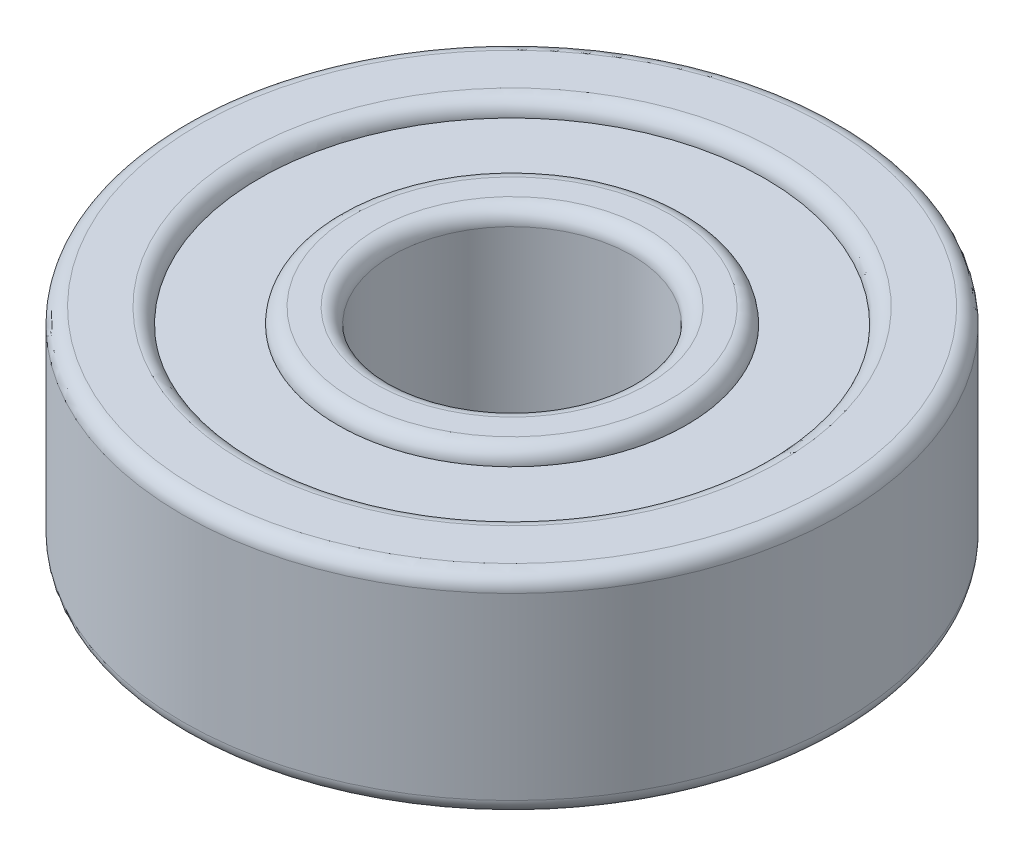
ISO-10303-21;
HEADER;
FILE_DESCRIPTION(('STEP AP214'),'2;1');
FILE_NAME('part.step','',(''),(''),'','','');
FILE_SCHEMA(('AUTOMOTIVE_DESIGN { 1 0 10303 214 1 1 1 1 }'));
ENDSEC;
DATA;
#1=APPLICATION_CONTEXT('core data for automotive mechanical design processes');
#2=APPLICATION_PROTOCOL_DEFINITION('international standard','automotive_design',2000,#1);
#3=PRODUCT_CONTEXT('',#1,'mechanical');
#4=PRODUCT('Part','Part','',(#3));
#5=PRODUCT_RELATED_PRODUCT_CATEGORY('part','',(#4));
#6=PRODUCT_DEFINITION_FORMATION('','',#4);
#7=PRODUCT_DEFINITION_CONTEXT('part definition',#1,'design');
#8=PRODUCT_DEFINITION('design','',#6,#7);
#9=PRODUCT_DEFINITION_SHAPE('','',#8);
#10=(LENGTH_UNIT() NAMED_UNIT(*) SI_UNIT(.MILLI.,.METRE.));
#11=(NAMED_UNIT(*) PLANE_ANGLE_UNIT() SI_UNIT($,.RADIAN.));
#12=(NAMED_UNIT(*) SI_UNIT($,.STERADIAN.) SOLID_ANGLE_UNIT());
#13=UNCERTAINTY_MEASURE_WITH_UNIT(LENGTH_MEASURE(1.E-05),#10,'distance_accuracy_value','');
#14=(GEOMETRIC_REPRESENTATION_CONTEXT(3) GLOBAL_UNCERTAINTY_ASSIGNED_CONTEXT((#13)) GLOBAL_UNIT_ASSIGNED_CONTEXT((#10,
#11,#12)) REPRESENTATION_CONTEXT('',''));
#15=CARTESIAN_POINT('',(0.,0.,0.));
#16=DIRECTION('',(0.,0.,1.));
#17=DIRECTION('',(1.,0.,0.));
#18=AXIS2_PLACEMENT_3D('',#15,#16,#17);
#19=CARTESIAN_POINT('',(0.,-26.8639331784423,0.));
#20=DIRECTION('',(0.,1.,0.));
#21=DIRECTION('',(0.,0.,-1.));
#22=AXIS2_PLACEMENT_3D('',#19,#20,#21);
#23=CYLINDRICAL_SURFACE('',#22,8.4400009);
#24=CARTESIAN_POINT('',(0.,-2.9920057,0.));
#25=DIRECTION('',(0.,-1.,0.));
#26=DIRECTION('',(0.,0.,-1.));
#27=AXIS2_PLACEMENT_3D('',#24,#25,#26);
#28=CIRCLE('',#27,8.4400009);
#29=CARTESIAN_POINT('',(0.,-2.9920057,-8.4400009));
#30=VERTEX_POINT('',#29);
#31=EDGE_CURVE('E50',#30,#30,#28,.F.);
#32=ORIENTED_EDGE('',*,*,#31,.T.);
#33=EDGE_LOOP('',(#32));
#34=FACE_BOUND('',#33,.T.);
#35=CARTESIAN_POINT('',(0.,-2.01495041180427,0.));
#36=DIRECTION('',(0.,-1.,0.));
#37=DIRECTION('',(0.,0.,-1.));
#38=AXIS2_PLACEMENT_3D('',#35,#36,#37);
#39=CIRCLE('',#38,8.4400009);
#40=CARTESIAN_POINT('',(0.,-2.01495041180427,-8.4400009));
#41=VERTEX_POINT('',#40);
#42=EDGE_CURVE('E54',#41,#41,#39,.T.);
#43=ORIENTED_EDGE('',*,*,#42,.T.);
#44=EDGE_LOOP('',(#43));
#45=FACE_BOUND('',#44,.T.);
#46=ADVANCED_FACE('F44',(#34,#45),#23,.T.);
#47=CARTESIAN_POINT('',(0.,-2.01495041180427,0.));
#48=DIRECTION('',(0.,1.,0.));
#49=DIRECTION('',(0.,0.,-1.));
#50=AXIS2_PLACEMENT_3D('',#47,#48,#49);
#51=PLANE('',#50);
#52=CARTESIAN_POINT('',(0.,-2.01495041180427,0.));
#53=DIRECTION('',(0.,-1.,0.));
#54=DIRECTION('',(0.,0.,-1.));
#55=AXIS2_PLACEMENT_3D('',#52,#53,#54);
#56=CIRCLE('',#55,5.8200036);
#57=CARTESIAN_POINT('',(0.,-2.01495041180427,-5.8200036));
#58=VERTEX_POINT('',#57);
#59=EDGE_CURVE('E59',#58,#58,#56,.T.);
#60=ORIENTED_EDGE('',*,*,#59,.T.);
#61=EDGE_LOOP('',(#60));
#62=FACE_BOUND('',#61,.T.);
#63=ORIENTED_EDGE('',*,*,#42,.F.);
#64=EDGE_LOOP('',(#63));
#65=FACE_BOUND('',#64,.T.);
#66=ADVANCED_FACE('F64',(#62,#65),#51,.T.);
#67=CARTESIAN_POINT('',(0.,-26.8639331784423,0.));
#68=DIRECTION('',(0.,1.,0.));
#69=DIRECTION('',(0.,0.,-1.));
#70=AXIS2_PLACEMENT_3D('',#67,#68,#69);
#71=CYLINDRICAL_SURFACE('',#70,5.8200036);
#72=CARTESIAN_POINT('',(0.,-2.9920057,0.));
#73=DIRECTION('',(0.,-1.,0.));
#74=DIRECTION('',(0.,0.,-1.));
#75=AXIS2_PLACEMENT_3D('',#72,#73,#74);
#76=CIRCLE('',#75,5.8200036);
#77=CARTESIAN_POINT('',(0.,-2.9920057,-5.8200036));
#78=VERTEX_POINT('',#77);
#79=EDGE_CURVE('E11',#78,#78,#76,.F.);
#80=ORIENTED_EDGE('',*,*,#79,.F.);
#81=EDGE_LOOP('',(#80));
#82=FACE_BOUND('',#81,.T.);
#83=ORIENTED_EDGE('',*,*,#59,.F.);
#84=EDGE_LOOP('',(#83));
#85=FACE_BOUND('',#84,.T.);
#86=ADVANCED_FACE('F67',(#82,#85),#71,.F.);
#87=CARTESIAN_POINT('',(0.,-2.9920057,0.));
#88=DIRECTION('',(0.,1.,0.));
#89=DIRECTION('',(0.,0.,-1.));
#90=AXIS2_PLACEMENT_3D('',#87,#88,#89);
#91=PLANE('',#90);
#92=ORIENTED_EDGE('',*,*,#31,.F.);
#93=EDGE_LOOP('',(#92));
#94=FACE_BOUND('',#93,.T.);
#95=ORIENTED_EDGE('',*,*,#79,.T.);
#96=EDGE_LOOP('',(#95));
#97=FACE_BOUND('',#96,.T.);
#98=ADVANCED_FACE('F69',(#94,#97),#91,.F.);
#99=CLOSED_SHELL('',(#46,#66,#86,#98));
#100=MANIFOLD_SOLID_BREP('B2',#99);
#101=CARTESIAN_POINT('',(0.,26.8639331784423,0.));
#102=DIRECTION('',(0.,-1.,0.));
#103=DIRECTION('',(0.,0.,-1.));
#104=AXIS2_PLACEMENT_3D('',#101,#102,#103);
#105=CYLINDRICAL_SURFACE('',#104,8.4400009);
#106=CARTESIAN_POINT('',(0.,2.9920057,0.));
#107=DIRECTION('',(0.,-1.,0.));
#108=DIRECTION('',(0.,0.,-1.));
#109=AXIS2_PLACEMENT_3D('',#106,#107,#108);
#110=CIRCLE('',#109,8.4400009);
#111=CARTESIAN_POINT('',(0.,2.9920057,-8.4400009));
#112=VERTEX_POINT('',#111);
#113=EDGE_CURVE('E138',#112,#112,#110,.F.);
#114=ORIENTED_EDGE('',*,*,#113,.F.);
#115=EDGE_LOOP('',(#114));
#116=FACE_BOUND('',#115,.T.);
#117=CARTESIAN_POINT('',(0.,2.01495041180427,0.));
#118=DIRECTION('',(0.,-1.,0.));
#119=DIRECTION('',(0.,0.,-1.));
#120=AXIS2_PLACEMENT_3D('',#117,#118,#119);
#121=CIRCLE('',#120,8.4400009);
#122=CARTESIAN_POINT('',(0.,2.01495041180427,-8.4400009));
#123=VERTEX_POINT('',#122);
#124=EDGE_CURVE('E142',#123,#123,#121,.T.);
#125=ORIENTED_EDGE('',*,*,#124,.F.);
#126=EDGE_LOOP('',(#125));
#127=FACE_BOUND('',#126,.T.);
#128=ADVANCED_FACE('F132',(#116,#127),#105,.T.);
#129=CARTESIAN_POINT('',(0.,2.01495041180427,0.));
#130=DIRECTION('',(0.,-1.,0.));
#131=DIRECTION('',(0.,0.,-1.));
#132=AXIS2_PLACEMENT_3D('',#129,#130,#131);
#133=PLANE('',#132);
#134=CARTESIAN_POINT('',(0.,2.01495041180427,0.));
#135=DIRECTION('',(0.,-1.,0.));
#136=DIRECTION('',(0.,0.,-1.));
#137=AXIS2_PLACEMENT_3D('',#134,#135,#136);
#138=CIRCLE('',#137,5.8200036);
#139=CARTESIAN_POINT('',(0.,2.01495041180427,-5.8200036));
#140=VERTEX_POINT('',#139);
#141=EDGE_CURVE('E147',#140,#140,#138,.T.);
#142=ORIENTED_EDGE('',*,*,#141,.F.);
#143=EDGE_LOOP('',(#142));
#144=FACE_BOUND('',#143,.T.);
#145=ORIENTED_EDGE('',*,*,#124,.T.);
#146=EDGE_LOOP('',(#145));
#147=FACE_BOUND('',#146,.T.);
#148=ADVANCED_FACE('F154',(#144,#147),#133,.T.);
#149=CARTESIAN_POINT('',(0.,26.8639331784423,0.));
#150=DIRECTION('',(0.,-1.,0.));
#151=DIRECTION('',(0.,0.,-1.));
#152=AXIS2_PLACEMENT_3D('',#149,#150,#151);
#153=CYLINDRICAL_SURFACE('',#152,5.8200036);
#154=CARTESIAN_POINT('',(0.,2.9920057,0.));
#155=DIRECTION('',(0.,-1.,0.));
#156=DIRECTION('',(0.,0.,-1.));
#157=AXIS2_PLACEMENT_3D('',#154,#155,#156);
#158=CIRCLE('',#157,5.8200036);
#159=CARTESIAN_POINT('',(0.,2.9920057,-5.8200036));
#160=VERTEX_POINT('',#159);
#161=EDGE_CURVE('E43',#160,#160,#158,.F.);
#162=ORIENTED_EDGE('',*,*,#161,.T.);
#163=EDGE_LOOP('',(#162));
#164=FACE_BOUND('',#163,.T.);
#165=ORIENTED_EDGE('',*,*,#141,.T.);
#166=EDGE_LOOP('',(#165));
#167=FACE_BOUND('',#166,.T.);
#168=ADVANCED_FACE('F152',(#164,#167),#153,.F.);
#169=CARTESIAN_POINT('',(0.,2.9920057,0.));
#170=DIRECTION('',(0.,-1.,0.));
#171=DIRECTION('',(0.,0.,-1.));
#172=AXIS2_PLACEMENT_3D('',#169,#170,#171);
#173=PLANE('',#172);
#174=ORIENTED_EDGE('',*,*,#113,.T.);
#175=EDGE_LOOP('',(#174));
#176=FACE_BOUND('',#175,.T.);
#177=ORIENTED_EDGE('',*,*,#161,.F.);
#178=EDGE_LOOP('',(#177));
#179=FACE_BOUND('',#178,.T.);
#180=ADVANCED_FACE('F173',(#176,#179),#173,.F.);
#181=CLOSED_SHELL('',(#128,#148,#168,#180));
#182=MANIFOLD_SOLID_BREP('B6',#181);
#183=CARTESIAN_POINT('',(5.68391542482456,0.,-4.53277129595592));
#184=DIRECTION('',(0.,1.,0.));
#185=DIRECTION('',(0.781831482468022,0.,-0.623489801858743));
#186=AXIS2_PLACEMENT_3D('',#183,#184,#185);
#187=SPHERICAL_SURFACE('',#186,2.3300055);
#188=CARTESIAN_POINT('',(5.68391542482456,2.3300055,-4.53277129595592));
#189=VERTEX_POINT('',#188);
#190=VERTEX_LOOP('',#189);
#191=FACE_BOUND('',#190,.T.);
#192=ADVANCED_FACE('F200',(#191),#187,.T.);
#193=CLOSED_SHELL('',(#192));
#194=MANIFOLD_SOLID_BREP('B38',#193);
#195=CARTESIAN_POINT('',(7.08772660401141,0.,1.61772734562699));
#196=DIRECTION('',(0.,1.,0.));
#197=DIRECTION('',(0.974927912181826,0.,0.222520933956305));
#198=AXIS2_PLACEMENT_3D('',#195,#196,#197);
#199=SPHERICAL_SURFACE('',#198,2.3300055);
#200=CARTESIAN_POINT('',(7.08772660401141,2.3300055,1.61772734562699));
#201=VERTEX_POINT('',#200);
#202=VERTEX_LOOP('',#201);
#203=FACE_BOUND('',#202,.T.);
#204=ADVANCED_FACE('F219',(#203),#199,.T.);
#205=CLOSED_SHELL('',(#204));
#206=MANIFOLD_SOLID_BREP('B128',#205);
#207=CARTESIAN_POINT('',(3.15433508710332,0.,6.55004430032877));
#208=DIRECTION('',(0.,1.,0.));
#209=DIRECTION('',(0.433883739117565,0.,0.900968867902416));
#210=AXIS2_PLACEMENT_3D('',#207,#208,#209);
#211=SPHERICAL_SURFACE('',#210,2.3300055);
#212=CARTESIAN_POINT('',(3.15433508710332,2.3300055,6.55004430032877));
#213=VERTEX_POINT('',#212);
#214=VERTEX_LOOP('',#213);
#215=FACE_BOUND('',#214,.T.);
#216=ADVANCED_FACE('F238',(#215),#211,.T.);
#217=CLOSED_SHELL('',(#216));
#218=MANIFOLD_SOLID_BREP('B196',#217);
#219=CARTESIAN_POINT('',(-3.15433508710322,0.,6.55004430032881));
#220=DIRECTION('',(0.,1.,0.));
#221=DIRECTION('',(-0.433883739117553,0.,0.900968867902422));
#222=AXIS2_PLACEMENT_3D('',#219,#220,#221);
#223=SPHERICAL_SURFACE('',#222,2.3300055);
#224=CARTESIAN_POINT('',(-3.15433508710322,2.3300055,6.55004430032881));
#225=VERTEX_POINT('',#224);
#226=VERTEX_LOOP('',#225);
#227=FACE_BOUND('',#226,.T.);
#228=ADVANCED_FACE('F257',(#227),#223,.T.);
#229=CLOSED_SHELL('',(#228));
#230=MANIFOLD_SOLID_BREP('B215',#229);
#231=CARTESIAN_POINT('',(-7.08772660401139,0.,1.61772734562709));
#232=DIRECTION('',(0.,1.,0.));
#233=DIRECTION('',(-0.974927912181823,0.,0.222520933956318));
#234=AXIS2_PLACEMENT_3D('',#231,#232,#233);
#235=SPHERICAL_SURFACE('',#234,2.3300055);
#236=CARTESIAN_POINT('',(-7.08772660401139,2.3300055,1.61772734562709));
#237=VERTEX_POINT('',#236);
#238=VERTEX_LOOP('',#237);
#239=FACE_BOUND('',#238,.T.);
#240=ADVANCED_FACE('F276',(#239),#235,.T.);
#241=CLOSED_SHELL('',(#240));
#242=MANIFOLD_SOLID_BREP('B234',#241);
#243=CARTESIAN_POINT('',(-5.68391542482462,0.,-4.53277129595584));
#244=DIRECTION('',(0.,1.,0.));
#245=DIRECTION('',(-0.781831482468031,0.,-0.623489801858732));
#246=AXIS2_PLACEMENT_3D('',#243,#244,#245);
#247=SPHERICAL_SURFACE('',#246,2.3300055);
#248=CARTESIAN_POINT('',(-5.68391542482462,2.3300055,-4.53277129595584));
#249=VERTEX_POINT('',#248);
#250=VERTEX_LOOP('',#249);
#251=FACE_BOUND('',#250,.T.);
#252=ADVANCED_FACE('F295',(#251),#247,.T.);
#253=CLOSED_SHELL('',(#252));
#254=MANIFOLD_SOLID_BREP('B253',#253);
#255=CARTESIAN_POINT('',(0.,0.,-7.2700007));
#256=DIRECTION('',(0.,1.,0.));
#257=DIRECTION('',(0.,0.,-1.));
#258=AXIS2_PLACEMENT_3D('',#255,#256,#257);
#259=SPHERICAL_SURFACE('',#258,2.3300055);
#260=CARTESIAN_POINT('',(0.,2.3300055,-7.2700007));
#261=VERTEX_POINT('',#260);
#262=VERTEX_LOOP('',#261);
#263=FACE_BOUND('',#262,.T.);
#264=ADVANCED_FACE('F316',(#263),#259,.T.);
#265=CLOSED_SHELL('',(#264));
#266=MANIFOLD_SOLID_BREP('B272',#265);
#267=CARTESIAN_POINT('',(0.,-3.5000057,0.));
#268=DIRECTION('',(0.,1.,0.));
#269=DIRECTION('',(0.,0.,1.));
#270=AXIS2_PLACEMENT_3D('',#267,#268,#269);
#271=CYLINDRICAL_SURFACE('',#270,8.4400009);
#272=CARTESIAN_POINT('',(0.,2.9920057,0.));
#273=DIRECTION('',(0.,1.,0.));
#274=DIRECTION('',(0.,0.,1.));
#275=AXIS2_PLACEMENT_3D('',#272,#273,#274);
#276=CIRCLE('',#275,8.4400009);
#277=CARTESIAN_POINT('',(0.,2.9920057,8.4400009));
#278=VERTEX_POINT('',#277);
#279=EDGE_CURVE('E356',#278,#278,#276,.T.);
#280=ORIENTED_EDGE('',*,*,#279,.T.);
#281=EDGE_LOOP('',(#280));
#282=FACE_BOUND('',#281,.T.);
#283=CARTESIAN_POINT('',(0.,2.01495041180427,0.));
#284=DIRECTION('',(0.,-1.,0.));
#285=DIRECTION('',(0.,0.,-1.));
#286=AXIS2_PLACEMENT_3D('',#283,#284,#285);
#287=CIRCLE('',#286,8.4400009);
#288=CARTESIAN_POINT('',(0.,2.01495041180427,-8.4400009));
#289=VERTEX_POINT('',#288);
#290=EDGE_CURVE('E368',#289,#289,#287,.F.);
#291=ORIENTED_EDGE('',*,*,#290,.F.);
#292=EDGE_LOOP('',(#291));
#293=FACE_BOUND('',#292,.T.);
#294=ADVANCED_FACE('F336',(#282,#293),#271,.F.);
#295=CARTESIAN_POINT('',(0.,-2.9920057,0.));
#296=DIRECTION('',(0.,1.,0.));
#297=DIRECTION('',(0.,0.,1.));
#298=AXIS2_PLACEMENT_3D('',#295,#296,#297);
#299=CIRCLE('',#298,8.4400009);
#300=CARTESIAN_POINT('',(0.,-2.9920057,8.4400009));
#301=VERTEX_POINT('',#300);
#302=EDGE_CURVE('E359',#301,#301,#299,.F.);
#303=ORIENTED_EDGE('',*,*,#302,.T.);
#304=EDGE_LOOP('',(#303));
#305=FACE_BOUND('',#304,.T.);
#306=CARTESIAN_POINT('',(0.,-2.01495041180427,0.));
#307=DIRECTION('',(0.,1.,0.));
#308=DIRECTION('',(0.,0.,1.));
#309=AXIS2_PLACEMENT_3D('',#306,#307,#308);
#310=CIRCLE('',#309,8.4400009);
#311=CARTESIAN_POINT('',(0.,-2.01495041180427,8.4400009));
#312=VERTEX_POINT('',#311);
#313=EDGE_CURVE('E371',#312,#312,#310,.F.);
#314=ORIENTED_EDGE('',*,*,#313,.F.);
#315=EDGE_LOOP('',(#314));
#316=FACE_BOUND('',#315,.T.);
#317=ADVANCED_FACE('F378',(#305,#316),#271,.F.);
#318=CARTESIAN_POINT('',(0.,3.5000057,0.));
#319=DIRECTION('',(0.,1.,0.));
#320=DIRECTION('',(0.,0.,1.));
#321=AXIS2_PLACEMENT_3D('',#318,#319,#320);
#322=PLANE('',#321);
#323=CARTESIAN_POINT('',(0.,3.5000057,0.));
#324=DIRECTION('',(0.,1.,0.));
#325=DIRECTION('',(0.,0.,1.));
#326=AXIS2_PLACEMENT_3D('',#323,#324,#325);
#327=CIRCLE('',#326,8.9480009);
#328=CARTESIAN_POINT('',(0.,3.5000057,8.9480009));
#329=VERTEX_POINT('',#328);
#330=EDGE_CURVE('E347',#329,#329,#327,.F.);
#331=ORIENTED_EDGE('',*,*,#330,.T.);
#332=EDGE_LOOP('',(#331));
#333=FACE_BOUND('',#332,.T.);
#334=CARTESIAN_POINT('',(0.,3.5000057,0.));
#335=DIRECTION('',(0.,1.,0.));
#336=DIRECTION('',(0.,0.,1.));
#337=AXIS2_PLACEMENT_3D('',#334,#335,#336);
#338=CIRCLE('',#337,10.4920034);
#339=CARTESIAN_POINT('',(0.,3.5000057,10.4920034));
#340=VERTEX_POINT('',#339);
#341=EDGE_CURVE('E351',#340,#340,#338,.T.);
#342=ORIENTED_EDGE('',*,*,#341,.T.);
#343=EDGE_LOOP('',(#342));
#344=FACE_BOUND('',#343,.T.);
#345=ADVANCED_FACE('F380',(#333,#344),#322,.T.);
#346=CARTESIAN_POINT('',(0.,-3.5000057,0.));
#347=DIRECTION('',(0.,1.,0.));
#348=DIRECTION('',(0.,0.,1.));
#349=AXIS2_PLACEMENT_3D('',#346,#347,#348);
#350=PLANE('',#349);
#351=CARTESIAN_POINT('',(0.,-3.5000057,0.));
#352=DIRECTION('',(0.,1.,0.));
#353=DIRECTION('',(0.,0.,1.));
#354=AXIS2_PLACEMENT_3D('',#351,#352,#353);
#355=CIRCLE('',#354,8.9480009);
#356=CARTESIAN_POINT('',(0.,-3.5000057,8.9480009));
#357=VERTEX_POINT('',#356);
#358=EDGE_CURVE('E362',#357,#357,#355,.T.);
#359=ORIENTED_EDGE('',*,*,#358,.T.);
#360=EDGE_LOOP('',(#359));
#361=FACE_BOUND('',#360,.T.);
#362=CARTESIAN_POINT('',(0.,-3.5000057,0.));
#363=DIRECTION('',(0.,1.,0.));
#364=DIRECTION('',(0.,0.,1.));
#365=AXIS2_PLACEMENT_3D('',#362,#363,#364);
#366=CIRCLE('',#365,10.4920034);
#367=CARTESIAN_POINT('',(0.,-3.5000057,10.4920034));
#368=VERTEX_POINT('',#367);
#369=EDGE_CURVE('E365',#368,#368,#366,.F.);
#370=ORIENTED_EDGE('',*,*,#369,.T.);
#371=EDGE_LOOP('',(#370));
#372=FACE_BOUND('',#371,.T.);
#373=ADVANCED_FACE('F387',(#361,#372),#350,.F.);
#374=CARTESIAN_POINT('',(0.,3.5000057,0.));
#375=DIRECTION('',(0.,-1.,0.));
#376=DIRECTION('',(0.,0.,-1.));
#377=AXIS2_PLACEMENT_3D('',#374,#375,#376);
#378=CYLINDRICAL_SURFACE('',#377,11.0000034);
#379=CARTESIAN_POINT('',(0.,-2.9920057,0.));
#380=DIRECTION('',(0.,1.,0.));
#381=DIRECTION('',(0.,0.,1.));
#382=AXIS2_PLACEMENT_3D('',#379,#380,#381);
#383=CIRCLE('',#382,11.0000034);
#384=CARTESIAN_POINT('',(0.,-2.9920057,11.0000034));
#385=VERTEX_POINT('',#384);
#386=EDGE_CURVE('E315',#385,#385,#383,.T.);
#387=ORIENTED_EDGE('',*,*,#386,.T.);
#388=EDGE_LOOP('',(#387));
#389=FACE_BOUND('',#388,.T.);
#390=CARTESIAN_POINT('',(0.,2.9920057,0.));
#391=DIRECTION('',(0.,1.,0.));
#392=DIRECTION('',(0.,0.,1.));
#393=AXIS2_PLACEMENT_3D('',#390,#391,#392);
#394=CIRCLE('',#393,11.0000034);
#395=CARTESIAN_POINT('',(0.,2.9920057,11.0000034));
#396=VERTEX_POINT('',#395);
#397=EDGE_CURVE('E343',#396,#396,#394,.F.);
#398=ORIENTED_EDGE('',*,*,#397,.T.);
#399=EDGE_LOOP('',(#398));
#400=FACE_BOUND('',#399,.T.);
#401=ADVANCED_FACE('F392',(#389,#400),#378,.T.);
#402=CARTESIAN_POINT('',(0.,0.,0.));
#403=DIRECTION('',(0.,1.,0.));
#404=DIRECTION('',(0.,0.,1.));
#405=AXIS2_PLACEMENT_3D('',#402,#403,#404);
#406=TOROIDAL_SURFACE('',#405,7.2700007,2.3300055);
#407=ORIENTED_EDGE('',*,*,#313,.T.);
#408=EDGE_LOOP('',(#407));
#409=FACE_BOUND('',#408,.T.);
#410=ORIENTED_EDGE('',*,*,#290,.T.);
#411=EDGE_LOOP('',(#410));
#412=FACE_BOUND('',#411,.T.);
#413=ADVANCED_FACE('F375',(#409,#412),#406,.F.);
#414=CARTESIAN_POINT('',(0.,-2.9920057,0.));
#415=DIRECTION('',(0.,1.,0.));
#416=DIRECTION('',(0.,0.,1.));
#417=AXIS2_PLACEMENT_3D('',#414,#415,#416);
#418=TOROIDAL_SURFACE('',#417,8.9480009,0.508);
#419=ORIENTED_EDGE('',*,*,#302,.F.);
#420=EDGE_LOOP('',(#419));
#421=FACE_BOUND('',#420,.T.);
#422=ORIENTED_EDGE('',*,*,#358,.F.);
#423=EDGE_LOOP('',(#422));
#424=FACE_BOUND('',#423,.T.);
#425=ADVANCED_FACE('F398',(#421,#424),#418,.T.);
#426=CARTESIAN_POINT('',(0.,2.9920057,0.));
#427=DIRECTION('',(0.,1.,0.));
#428=DIRECTION('',(0.,0.,1.));
#429=AXIS2_PLACEMENT_3D('',#426,#427,#428);
#430=TOROIDAL_SURFACE('',#429,8.9480009,0.508);
#431=ORIENTED_EDGE('',*,*,#330,.F.);
#432=EDGE_LOOP('',(#431));
#433=FACE_BOUND('',#432,.T.);
#434=ORIENTED_EDGE('',*,*,#279,.F.);
#435=EDGE_LOOP('',(#434));
#436=FACE_BOUND('',#435,.T.);
#437=ADVANCED_FACE('F401',(#433,#436),#430,.T.);
#438=CARTESIAN_POINT('',(0.,-2.9920057,0.));
#439=DIRECTION('',(0.,1.,0.));
#440=DIRECTION('',(0.,0.,1.));
#441=AXIS2_PLACEMENT_3D('',#438,#439,#440);
#442=TOROIDAL_SURFACE('',#441,10.4920034,0.508);
#443=ORIENTED_EDGE('',*,*,#369,.F.);
#444=EDGE_LOOP('',(#443));
#445=FACE_BOUND('',#444,.T.);
#446=ORIENTED_EDGE('',*,*,#386,.F.);
#447=EDGE_LOOP('',(#446));
#448=FACE_BOUND('',#447,.T.);
#449=ADVANCED_FACE('F404',(#445,#448),#442,.T.);
#450=CARTESIAN_POINT('',(0.,2.9920057,0.));
#451=DIRECTION('',(0.,1.,0.));
#452=DIRECTION('',(0.,0.,1.));
#453=AXIS2_PLACEMENT_3D('',#450,#451,#452);
#454=TOROIDAL_SURFACE('',#453,10.4920034,0.508);
#455=ORIENTED_EDGE('',*,*,#397,.F.);
#456=EDGE_LOOP('',(#455));
#457=FACE_BOUND('',#456,.T.);
#458=ORIENTED_EDGE('',*,*,#341,.F.);
#459=EDGE_LOOP('',(#458));
#460=FACE_BOUND('',#459,.T.);
#461=ADVANCED_FACE('F338',(#457,#460),#454,.T.);
#462=CLOSED_SHELL('',(#294,#317,#345,#373,#401,#413,#425,#437,#449,#461));
#463=MANIFOLD_SOLID_BREP('B291',#462);
#464=CARTESIAN_POINT('',(0.,-3.5000057,0.));
#465=DIRECTION('',(0.,1.,0.));
#466=DIRECTION('',(0.,0.,1.));
#467=AXIS2_PLACEMENT_3D('',#464,#465,#466);
#468=CYLINDRICAL_SURFACE('',#467,5.8200036);
#469=CARTESIAN_POINT('',(0.,2.9920057,0.));
#470=DIRECTION('',(0.,1.,0.));
#471=DIRECTION('',(0.,0.,1.));
#472=AXIS2_PLACEMENT_3D('',#469,#470,#471);
#473=CIRCLE('',#472,5.8200036);
#474=CARTESIAN_POINT('',(0.,2.9920057,5.8200036));
#475=VERTEX_POINT('',#474);
#476=EDGE_CURVE('E335',#475,#475,#473,.F.);
#477=ORIENTED_EDGE('',*,*,#476,.T.);
#478=EDGE_LOOP('',(#477));
#479=FACE_BOUND('',#478,.T.);
#480=CARTESIAN_POINT('',(0.,1.8238514303588,0.));
#481=DIRECTION('',(0.,-1.,0.));
#482=DIRECTION('',(0.,0.,-1.));
#483=AXIS2_PLACEMENT_3D('',#480,#481,#482);
#484=CIRCLE('',#483,5.8200036);
#485=CARTESIAN_POINT('',(0.,1.8238514303588,-5.8200036));
#486=VERTEX_POINT('',#485);
#487=EDGE_CURVE('E519',#486,#486,#484,.F.);
#488=ORIENTED_EDGE('',*,*,#487,.T.);
#489=EDGE_LOOP('',(#488));
#490=FACE_BOUND('',#489,.T.);
#491=ADVANCED_FACE('F487',(#479,#490),#468,.T.);
#492=CARTESIAN_POINT('',(0.,-2.9920057,0.));
#493=DIRECTION('',(0.,1.,0.));
#494=DIRECTION('',(0.,0.,1.));
#495=AXIS2_PLACEMENT_3D('',#492,#493,#494);
#496=CIRCLE('',#495,5.8200036);
#497=CARTESIAN_POINT('',(0.,-2.9920057,5.8200036));
#498=VERTEX_POINT('',#497);
#499=EDGE_CURVE('E502',#498,#498,#496,.T.);
#500=ORIENTED_EDGE('',*,*,#499,.T.);
#501=EDGE_LOOP('',(#500));
#502=FACE_BOUND('',#501,.T.);
#503=CARTESIAN_POINT('',(0.,-1.8238514303588,0.));
#504=DIRECTION('',(0.,1.,0.));
#505=DIRECTION('',(0.,0.,1.));
#506=AXIS2_PLACEMENT_3D('',#503,#504,#505);
#507=CIRCLE('',#506,5.8200036);
#508=CARTESIAN_POINT('',(0.,-1.8238514303588,5.8200036));
#509=VERTEX_POINT('',#508);
#510=EDGE_CURVE('E522',#509,#509,#507,.F.);
#511=ORIENTED_EDGE('',*,*,#510,.T.);
#512=EDGE_LOOP('',(#511));
#513=FACE_BOUND('',#512,.T.);
#514=ADVANCED_FACE('F526',(#502,#513),#468,.T.);
#515=CARTESIAN_POINT('',(0.,3.5000057,0.));
#516=DIRECTION('',(0.,1.,0.));
#517=DIRECTION('',(0.,0.,1.));
#518=AXIS2_PLACEMENT_3D('',#515,#516,#517);
#519=PLANE('',#518);
#520=CARTESIAN_POINT('',(0.,3.5000057,0.));
#521=DIRECTION('',(0.,1.,0.));
#522=DIRECTION('',(0.,0.,1.));
#523=AXIS2_PLACEMENT_3D('',#520,#521,#522);
#524=CIRCLE('',#523,4.5080047);
#525=CARTESIAN_POINT('',(0.,3.5000057,4.5080047));
#526=VERTEX_POINT('',#525);
#527=EDGE_CURVE('E494',#526,#526,#524,.F.);
#528=ORIENTED_EDGE('',*,*,#527,.T.);
#529=EDGE_LOOP('',(#528));
#530=FACE_BOUND('',#529,.T.);
#531=CARTESIAN_POINT('',(0.,3.5000057,0.));
#532=DIRECTION('',(0.,1.,0.));
#533=DIRECTION('',(0.,0.,1.));
#534=AXIS2_PLACEMENT_3D('',#531,#532,#533);
#535=CIRCLE('',#534,5.3120036);
#536=CARTESIAN_POINT('',(0.,3.5000057,5.3120036));
#537=VERTEX_POINT('',#536);
#538=EDGE_CURVE('E498',#537,#537,#535,.T.);
#539=ORIENTED_EDGE('',*,*,#538,.T.);
#540=EDGE_LOOP('',(#539));
#541=FACE_BOUND('',#540,.T.);
#542=ADVANCED_FACE('F550',(#530,#541),#519,.T.);
#543=CARTESIAN_POINT('',(0.,3.5000057,0.));
#544=DIRECTION('',(0.,-1.,0.));
#545=DIRECTION('',(0.,0.,-1.));
#546=AXIS2_PLACEMENT_3D('',#543,#544,#545);
#547=CYLINDRICAL_SURFACE('',#546,4.0000047);
#548=CARTESIAN_POINT('',(0.,-2.9920057,0.));
#549=DIRECTION('',(0.,1.,0.));
#550=DIRECTION('',(0.,0.,1.));
#551=AXIS2_PLACEMENT_3D('',#548,#549,#550);
#552=CIRCLE('',#551,4.0000047);
#553=CARTESIAN_POINT('',(0.,-2.9920057,4.0000047));
#554=VERTEX_POINT('',#553);
#555=EDGE_CURVE('E507',#554,#554,#552,.F.);
#556=ORIENTED_EDGE('',*,*,#555,.T.);
#557=EDGE_LOOP('',(#556));
#558=FACE_BOUND('',#557,.T.);
#559=CARTESIAN_POINT('',(0.,2.9920057,0.));
#560=DIRECTION('',(0.,1.,0.));
#561=DIRECTION('',(0.,0.,1.));
#562=AXIS2_PLACEMENT_3D('',#559,#560,#561);
#563=CIRCLE('',#562,4.0000047);
#564=CARTESIAN_POINT('',(0.,2.9920057,4.0000047));
#565=VERTEX_POINT('',#564);
#566=EDGE_CURVE('E510',#565,#565,#563,.T.);
#567=ORIENTED_EDGE('',*,*,#566,.T.);
#568=EDGE_LOOP('',(#567));
#569=FACE_BOUND('',#568,.T.);
#570=ADVANCED_FACE('F541',(#558,#569),#547,.F.);
#571=CARTESIAN_POINT('',(0.,-3.5000057,0.));
#572=DIRECTION('',(0.,1.,0.));
#573=DIRECTION('',(0.,0.,1.));
#574=AXIS2_PLACEMENT_3D('',#571,#572,#573);
#575=PLANE('',#574);
#576=CARTESIAN_POINT('',(0.,-3.5000057,0.));
#577=DIRECTION('',(0.,1.,0.));
#578=DIRECTION('',(0.,0.,1.));
#579=AXIS2_PLACEMENT_3D('',#576,#577,#578);
#580=CIRCLE('',#579,4.5080047);
#581=CARTESIAN_POINT('',(0.,-3.5000057,4.5080047));
#582=VERTEX_POINT('',#581);
#583=EDGE_CURVE('E513',#582,#582,#580,.T.);
#584=ORIENTED_EDGE('',*,*,#583,.T.);
#585=EDGE_LOOP('',(#584));
#586=FACE_BOUND('',#585,.T.);
#587=CARTESIAN_POINT('',(0.,-3.5000057,0.));
#588=DIRECTION('',(0.,1.,0.));
#589=DIRECTION('',(0.,0.,1.));
#590=AXIS2_PLACEMENT_3D('',#587,#588,#589);
#591=CIRCLE('',#590,5.3120036);
#592=CARTESIAN_POINT('',(0.,-3.5000057,5.3120036));
#593=VERTEX_POINT('',#592);
#594=EDGE_CURVE('E516',#593,#593,#591,.F.);
#595=ORIENTED_EDGE('',*,*,#594,.T.);
#596=EDGE_LOOP('',(#595));
#597=FACE_BOUND('',#596,.T.);
#598=ADVANCED_FACE('F531',(#586,#597),#575,.F.);
#599=CARTESIAN_POINT('',(0.,0.,0.));
#600=DIRECTION('',(0.,1.,0.));
#601=DIRECTION('',(0.,0.,1.));
#602=AXIS2_PLACEMENT_3D('',#599,#600,#601);
#603=TOROIDAL_SURFACE('',#602,7.2700007,2.3300055);
#604=ORIENTED_EDGE('',*,*,#487,.F.);
#605=EDGE_LOOP('',(#604));
#606=FACE_BOUND('',#605,.T.);
#607=ORIENTED_EDGE('',*,*,#510,.F.);
#608=EDGE_LOOP('',(#607));
#609=FACE_BOUND('',#608,.T.);
#610=ADVANCED_FACE('F528',(#606,#609),#603,.F.);
#611=CARTESIAN_POINT('',(0.,-2.9920057,0.));
#612=DIRECTION('',(0.,1.,0.));
#613=DIRECTION('',(0.,0.,1.));
#614=AXIS2_PLACEMENT_3D('',#611,#612,#613);
#615=TOROIDAL_SURFACE('',#614,4.5080047,0.508);
#616=ORIENTED_EDGE('',*,*,#555,.F.);
#617=EDGE_LOOP('',(#616));
#618=FACE_BOUND('',#617,.T.);
#619=ORIENTED_EDGE('',*,*,#583,.F.);
#620=EDGE_LOOP('',(#619));
#621=FACE_BOUND('',#620,.T.);
#622=ADVANCED_FACE('F530',(#618,#621),#615,.T.);
#623=CARTESIAN_POINT('',(0.,-2.9920057,0.));
#624=DIRECTION('',(0.,1.,0.));
#625=DIRECTION('',(0.,0.,1.));
#626=AXIS2_PLACEMENT_3D('',#623,#624,#625);
#627=TOROIDAL_SURFACE('',#626,5.3120036,0.508);
#628=ORIENTED_EDGE('',*,*,#594,.F.);
#629=EDGE_LOOP('',(#628));
#630=FACE_BOUND('',#629,.T.);
#631=ORIENTED_EDGE('',*,*,#499,.F.);
#632=EDGE_LOOP('',(#631));
#633=FACE_BOUND('',#632,.T.);
#634=ADVANCED_FACE('F538',(#630,#633),#627,.T.);
#635=CARTESIAN_POINT('',(0.,2.9920057,0.));
#636=DIRECTION('',(0.,1.,0.));
#637=DIRECTION('',(0.,0.,1.));
#638=AXIS2_PLACEMENT_3D('',#635,#636,#637);
#639=TOROIDAL_SURFACE('',#638,4.5080047,0.508);
#640=ORIENTED_EDGE('',*,*,#527,.F.);
#641=EDGE_LOOP('',(#640));
#642=FACE_BOUND('',#641,.T.);
#643=ORIENTED_EDGE('',*,*,#566,.F.);
#644=EDGE_LOOP('',(#643));
#645=FACE_BOUND('',#644,.T.);
#646=ADVANCED_FACE('F560',(#642,#645),#639,.T.);
#647=CARTESIAN_POINT('',(0.,2.9920057,0.));
#648=DIRECTION('',(0.,1.,0.));
#649=DIRECTION('',(0.,0.,1.));
#650=AXIS2_PLACEMENT_3D('',#647,#648,#649);
#651=TOROIDAL_SURFACE('',#650,5.3120036,0.508);
#652=ORIENTED_EDGE('',*,*,#476,.F.);
#653=EDGE_LOOP('',(#652));
#654=FACE_BOUND('',#653,.T.);
#655=ORIENTED_EDGE('',*,*,#538,.F.);
#656=EDGE_LOOP('',(#655));
#657=FACE_BOUND('',#656,.T.);
#658=ADVANCED_FACE('F489',(#654,#657),#651,.T.);
#659=CLOSED_SHELL('',(#491,#514,#542,#570,#598,#610,#622,#634,#646,#658));
#660=MANIFOLD_SOLID_BREP('B310',#659);
#661=ADVANCED_BREP_SHAPE_REPRESENTATION('',(#18,#100,#182,#194,#206,#218,#230,#242,#254,#266,
#463,#660),#14);
#662=SHAPE_DEFINITION_REPRESENTATION(#9,#661);
ENDSEC;
END-ISO-10303-21;
